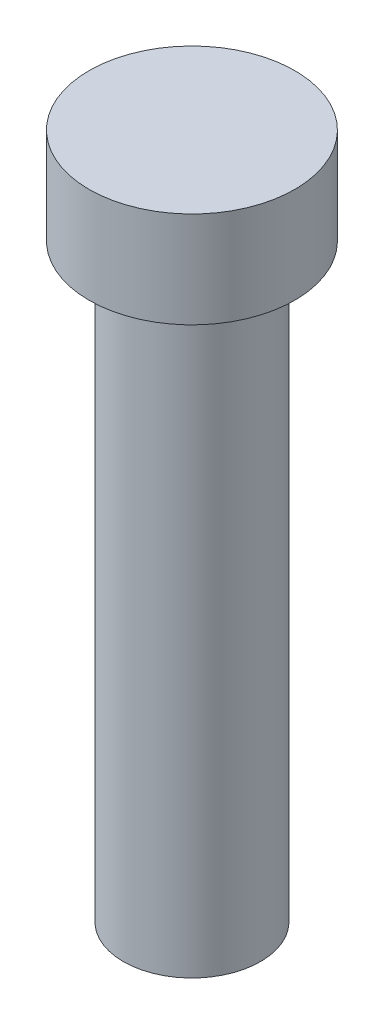
ISO-10303-21;
HEADER;
FILE_DESCRIPTION(('STEP AP214'),'2;1');
FILE_NAME('part.step','',(''),(''),'','','');
FILE_SCHEMA(('AUTOMOTIVE_DESIGN { 1 0 10303 214 1 1 1 1 }'));
ENDSEC;
DATA;
#1=APPLICATION_CONTEXT('core data for automotive mechanical design processes');
#2=APPLICATION_PROTOCOL_DEFINITION('international standard','automotive_design',2000,#1);
#3=PRODUCT_CONTEXT('',#1,'mechanical');
#4=PRODUCT('Part','Part','',(#3));
#5=PRODUCT_RELATED_PRODUCT_CATEGORY('part','',(#4));
#6=PRODUCT_DEFINITION_FORMATION('','',#4);
#7=PRODUCT_DEFINITION_CONTEXT('part definition',#1,'design');
#8=PRODUCT_DEFINITION('design','',#6,#7);
#9=PRODUCT_DEFINITION_SHAPE('','',#8);
#10=(LENGTH_UNIT() NAMED_UNIT(*) SI_UNIT(.MILLI.,.METRE.));
#11=(NAMED_UNIT(*) PLANE_ANGLE_UNIT() SI_UNIT($,.RADIAN.));
#12=(NAMED_UNIT(*) SI_UNIT($,.STERADIAN.) SOLID_ANGLE_UNIT());
#13=UNCERTAINTY_MEASURE_WITH_UNIT(LENGTH_MEASURE(1.E-05),#10,'distance_accuracy_value','');
#14=(GEOMETRIC_REPRESENTATION_CONTEXT(3) GLOBAL_UNCERTAINTY_ASSIGNED_CONTEXT((#13)) GLOBAL_UNIT_ASSIGNED_CONTEXT((#10,
#11,#12)) REPRESENTATION_CONTEXT('',''));
#15=CARTESIAN_POINT('',(0.,0.,0.));
#16=DIRECTION('',(0.,0.,1.));
#17=DIRECTION('',(1.,0.,0.));
#18=AXIS2_PLACEMENT_3D('',#15,#16,#17);
#19=CARTESIAN_POINT('',(0.,43.,0.));
#20=DIRECTION('',(0.,-1.,0.));
#21=DIRECTION('',(0.,0.,-1.));
#22=AXIS2_PLACEMENT_3D('',#19,#20,#21);
#23=CYLINDRICAL_SURFACE('',#22,5.);
#24=CARTESIAN_POINT('',(0.,43.,0.));
#25=DIRECTION('',(0.,1.,0.));
#26=DIRECTION('',(0.,0.,1.));
#27=AXIS2_PLACEMENT_3D('',#24,#25,#26);
#28=CIRCLE('',#27,5.);
#29=CARTESIAN_POINT('',(0.,43.,5.));
#30=VERTEX_POINT('',#29);
#31=EDGE_CURVE('E10',#30,#30,#28,.T.);
#32=ORIENTED_EDGE('',*,*,#31,.F.);
#33=EDGE_LOOP('',(#32));
#34=FACE_BOUND('',#33,.T.);
#35=CARTESIAN_POINT('',(0.,0.,0.));
#36=DIRECTION('',(0.,1.,0.));
#37=DIRECTION('',(0.,0.,1.));
#38=AXIS2_PLACEMENT_3D('',#35,#36,#37);
#39=CIRCLE('',#38,5.);
#40=CARTESIAN_POINT('',(0.,0.,5.));
#41=VERTEX_POINT('',#40);
#42=EDGE_CURVE('E33',#41,#41,#39,.T.);
#43=ORIENTED_EDGE('',*,*,#42,.T.);
#44=EDGE_LOOP('',(#43));
#45=FACE_BOUND('',#44,.T.);
#46=ADVANCED_FACE('F30',(#34,#45),#23,.T.);
#47=CARTESIAN_POINT('',(0.,0.,0.));
#48=DIRECTION('',(0.,1.,0.));
#49=DIRECTION('',(0.,0.,1.));
#50=AXIS2_PLACEMENT_3D('',#47,#48,#49);
#51=PLANE('',#50);
#52=ORIENTED_EDGE('',*,*,#42,.F.);
#53=EDGE_LOOP('',(#52));
#54=FACE_BOUND('',#53,.T.);
#55=ADVANCED_FACE('F53',(#54),#51,.F.);
#56=CARTESIAN_POINT('',(0.,50.,0.));
#57=DIRECTION('',(0.,-1.,0.));
#58=DIRECTION('',(0.,0.,-1.));
#59=AXIS2_PLACEMENT_3D('',#56,#57,#58);
#60=CYLINDRICAL_SURFACE('',#59,7.5);
#61=CARTESIAN_POINT('',(0.,50.,0.));
#62=DIRECTION('',(0.,1.,0.));
#63=DIRECTION('',(0.,0.,1.));
#64=AXIS2_PLACEMENT_3D('',#61,#62,#63);
#65=CIRCLE('',#64,7.5);
#66=CARTESIAN_POINT('',(0.,50.,7.5));
#67=VERTEX_POINT('',#66);
#68=EDGE_CURVE('E40',#67,#67,#65,.T.);
#69=ORIENTED_EDGE('',*,*,#68,.F.);
#70=EDGE_LOOP('',(#69));
#71=FACE_BOUND('',#70,.T.);
#72=CARTESIAN_POINT('',(0.,43.,0.));
#73=DIRECTION('',(0.,1.,0.));
#74=DIRECTION('',(0.,0.,1.));
#75=AXIS2_PLACEMENT_3D('',#72,#73,#74);
#76=CIRCLE('',#75,7.5);
#77=CARTESIAN_POINT('',(0.,43.,7.5));
#78=VERTEX_POINT('',#77);
#79=EDGE_CURVE('E42',#78,#78,#76,.T.);
#80=ORIENTED_EDGE('',*,*,#79,.T.);
#81=EDGE_LOOP('',(#80));
#82=FACE_BOUND('',#81,.T.);
#83=ADVANCED_FACE('F50',(#71,#82),#60,.T.);
#84=CARTESIAN_POINT('',(0.,50.,0.));
#85=DIRECTION('',(0.,1.,0.));
#86=DIRECTION('',(0.,0.,1.));
#87=AXIS2_PLACEMENT_3D('',#84,#85,#86);
#88=PLANE('',#87);
#89=ORIENTED_EDGE('',*,*,#68,.T.);
#90=EDGE_LOOP('',(#89));
#91=FACE_BOUND('',#90,.T.);
#92=ADVANCED_FACE('F48',(#91),#88,.T.);
#93=CARTESIAN_POINT('',(0.,43.,0.));
#94=DIRECTION('',(0.,1.,0.));
#95=DIRECTION('',(0.,0.,1.));
#96=AXIS2_PLACEMENT_3D('',#93,#94,#95);
#97=PLANE('',#96);
#98=ORIENTED_EDGE('',*,*,#31,.T.);
#99=EDGE_LOOP('',(#98));
#100=FACE_BOUND('',#99,.T.);
#101=ORIENTED_EDGE('',*,*,#79,.F.);
#102=EDGE_LOOP('',(#101));
#103=FACE_BOUND('',#102,.T.);
#104=ADVANCED_FACE('F57',(#100,#103),#97,.F.);
#105=CLOSED_SHELL('',(#46,#55,#83,#92,#104));
#106=MANIFOLD_SOLID_BREP('B2',#105);
#107=ADVANCED_BREP_SHAPE_REPRESENTATION('',(#18,#106),#14);
#108=SHAPE_DEFINITION_REPRESENTATION(#9,#107);
ENDSEC;
END-ISO-10303-21;
